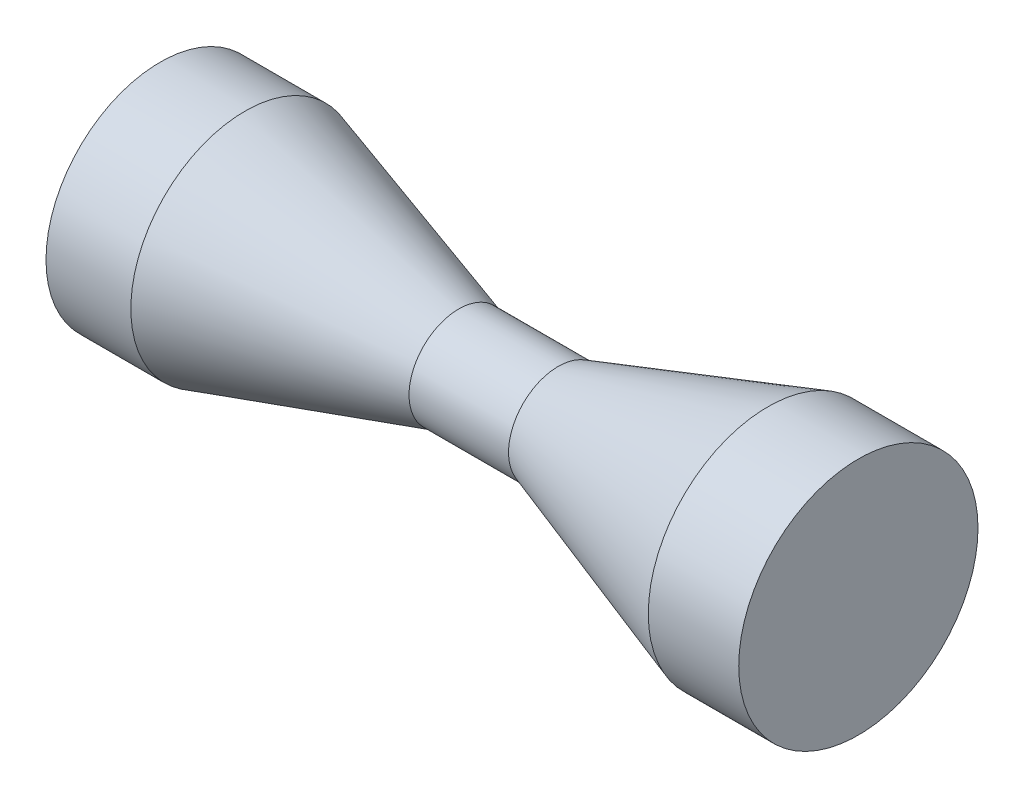
ISO-10303-21;
HEADER;
FILE_DESCRIPTION(('STEP AP214'),'2;1');
FILE_NAME('part.step','',(''),(''),'','','');
FILE_SCHEMA(('AUTOMOTIVE_DESIGN { 1 0 10303 214 1 1 1 1 }'));
ENDSEC;
DATA;
#1=APPLICATION_CONTEXT('core data for automotive mechanical design processes');
#2=APPLICATION_PROTOCOL_DEFINITION('international standard','automotive_design',2000,#1);
#3=PRODUCT_CONTEXT('',#1,'mechanical');
#4=PRODUCT('Part','Part','',(#3));
#5=PRODUCT_RELATED_PRODUCT_CATEGORY('part','',(#4));
#6=PRODUCT_DEFINITION_FORMATION('','',#4);
#7=PRODUCT_DEFINITION_CONTEXT('part definition',#1,'design');
#8=PRODUCT_DEFINITION('design','',#6,#7);
#9=PRODUCT_DEFINITION_SHAPE('','',#8);
#10=(LENGTH_UNIT() NAMED_UNIT(*) SI_UNIT(.MILLI.,.METRE.));
#11=(NAMED_UNIT(*) PLANE_ANGLE_UNIT() SI_UNIT($,.RADIAN.));
#12=(NAMED_UNIT(*) SI_UNIT($,.STERADIAN.) SOLID_ANGLE_UNIT());
#13=UNCERTAINTY_MEASURE_WITH_UNIT(LENGTH_MEASURE(1.E-05),#10,'distance_accuracy_value','');
#14=(GEOMETRIC_REPRESENTATION_CONTEXT(3) GLOBAL_UNCERTAINTY_ASSIGNED_CONTEXT((#13)) GLOBAL_UNIT_ASSIGNED_CONTEXT((#10,
#11,#12)) REPRESENTATION_CONTEXT('',''));
#15=CARTESIAN_POINT('',(0.,0.,0.));
#16=DIRECTION('',(0.,0.,1.));
#17=DIRECTION('',(1.,0.,0.));
#18=AXIS2_PLACEMENT_3D('',#15,#16,#17);
#19=CARTESIAN_POINT('',(0.,0.,0.));
#20=DIRECTION('',(1.,0.,0.));
#21=DIRECTION('',(0.,0.,-1.));
#22=AXIS2_PLACEMENT_3D('',#19,#20,#21);
#23=CYLINDRICAL_SURFACE('',#22,17.6042446248657);
#24=CARTESIAN_POINT('',(-38.6157624029311,0.,0.));
#25=DIRECTION('',(1.,0.,0.));
#26=DIRECTION('',(0.,0.,-1.));
#27=AXIS2_PLACEMENT_3D('',#24,#25,#26);
#28=CIRCLE('',#27,17.6042446248657);
#29=CARTESIAN_POINT('',(-38.6157624029311,0.,-17.6042446248657));
#30=VERTEX_POINT('',#29);
#31=EDGE_CURVE('E69',#30,#30,#28,.T.);
#32=ORIENTED_EDGE('',*,*,#31,.F.);
#33=EDGE_LOOP('',(#32));
#34=FACE_BOUND('',#33,.T.);
#35=CARTESIAN_POINT('',(-51.6894001508305,0.,0.));
#36=DIRECTION('',(-1.,0.,0.));
#37=DIRECTION('',(0.,0.,1.));
#38=AXIS2_PLACEMENT_3D('',#35,#36,#37);
#39=CIRCLE('',#38,17.6042446248657);
#40=CARTESIAN_POINT('',(-51.6894001508305,0.,17.6042446248657));
#41=VERTEX_POINT('',#40);
#42=EDGE_CURVE('E85',#41,#41,#39,.T.);
#43=ORIENTED_EDGE('',*,*,#42,.F.);
#44=EDGE_LOOP('',(#43));
#45=FACE_BOUND('',#44,.T.);
#46=ADVANCED_FACE('F40',(#34,#45),#23,.T.);
#47=CARTESIAN_POINT('',(-38.6157624029311,0.,0.));
#48=DIRECTION('',(-1.,0.,0.));
#49=DIRECTION('',(0.,0.,1.));
#50=AXIS2_PLACEMENT_3D('',#47,#48,#49);
#51=CONICAL_SURFACE('',#50,17.6042446248657,0.293037820828516);
#52=CARTESIAN_POINT('',(-5.67878858866636,0.,0.));
#53=DIRECTION('',(1.,0.,0.));
#54=DIRECTION('',(0.,0.,-1.));
#55=AXIS2_PLACEMENT_3D('',#52,#53,#54);
#56=CIRCLE('',#55,7.66636459469956);
#57=CARTESIAN_POINT('',(-5.67878858866636,0.,-7.66636459469956));
#58=VERTEX_POINT('',#57);
#59=EDGE_CURVE('E73',#58,#58,#56,.T.);
#60=ORIENTED_EDGE('',*,*,#59,.F.);
#61=EDGE_LOOP('',(#60));
#62=FACE_BOUND('',#61,.T.);
#63=ORIENTED_EDGE('',*,*,#31,.T.);
#64=EDGE_LOOP('',(#63));
#65=FACE_BOUND('',#64,.T.);
#66=ADVANCED_FACE('F117',(#62,#65),#51,.T.);
#67=CARTESIAN_POINT('',(0.,0.,0.));
#68=DIRECTION('',(1.,0.,0.));
#69=DIRECTION('',(0.,0.,-1.));
#70=AXIS2_PLACEMENT_3D('',#67,#68,#69);
#71=CYLINDRICAL_SURFACE('',#70,7.66636459469956);
#72=CARTESIAN_POINT('',(9.65394060073277,0.,0.));
#73=DIRECTION('',(1.,0.,0.));
#74=DIRECTION('',(0.,0.,-1.));
#75=AXIS2_PLACEMENT_3D('',#72,#73,#74);
#76=CIRCLE('',#75,7.66636459469956);
#77=CARTESIAN_POINT('',(9.65394060073277,0.,-7.66636459469956));
#78=VERTEX_POINT('',#77);
#79=EDGE_CURVE('E77',#78,#78,#76,.T.);
#80=ORIENTED_EDGE('',*,*,#79,.F.);
#81=EDGE_LOOP('',(#80));
#82=FACE_BOUND('',#81,.T.);
#83=ORIENTED_EDGE('',*,*,#59,.T.);
#84=EDGE_LOOP('',(#83));
#85=FACE_BOUND('',#84,.T.);
#86=ADVANCED_FACE('F112',(#82,#85),#71,.T.);
#87=CARTESIAN_POINT('',(9.65394060073277,0.,0.));
#88=DIRECTION('',(1.,0.,0.));
#89=DIRECTION('',(0.,0.,-1.));
#90=AXIS2_PLACEMENT_3D('',#87,#88,#89);
#91=CONICAL_SURFACE('',#90,7.66636459469956,0.321750554396642);
#92=CARTESIAN_POINT('',(41.9687141465649,0.,0.));
#93=DIRECTION('',(1.,0.,0.));
#94=DIRECTION('',(0.,0.,-1.));
#95=AXIS2_PLACEMENT_3D('',#92,#93,#94);
#96=CIRCLE('',#95,18.4379557766436);
#97=CARTESIAN_POINT('',(41.9687141465649,0.,-18.4379557766436));
#98=VERTEX_POINT('',#97);
#99=EDGE_CURVE('E81',#98,#98,#96,.T.);
#100=ORIENTED_EDGE('',*,*,#99,.F.);
#101=EDGE_LOOP('',(#100));
#102=FACE_BOUND('',#101,.T.);
#103=ORIENTED_EDGE('',*,*,#79,.T.);
#104=EDGE_LOOP('',(#103));
#105=FACE_BOUND('',#104,.T.);
#106=ADVANCED_FACE('F103',(#102,#105),#91,.T.);
#107=CARTESIAN_POINT('',(0.,0.,0.));
#108=DIRECTION('',(1.,0.,0.));
#109=DIRECTION('',(0.,0.,-1.));
#110=AXIS2_PLACEMENT_3D('',#107,#108,#109);
#111=CYLINDRICAL_SURFACE('',#110,18.4379557766436);
#112=ORIENTED_EDGE('',*,*,#99,.T.);
#113=EDGE_LOOP('',(#112));
#114=FACE_BOUND('',#113,.T.);
#115=CARTESIAN_POINT('',(55.9050132964019,0.,0.));
#116=DIRECTION('',(1.,0.,0.));
#117=DIRECTION('',(0.,0.,-1.));
#118=AXIS2_PLACEMENT_3D('',#115,#116,#117);
#119=CIRCLE('',#118,18.4379557766436);
#120=CARTESIAN_POINT('',(55.9050132964019,0.,-18.4379557766436));
#121=VERTEX_POINT('',#120);
#122=EDGE_CURVE('E90',#121,#121,#119,.T.);
#123=ORIENTED_EDGE('',*,*,#122,.F.);
#124=EDGE_LOOP('',(#123));
#125=FACE_BOUND('',#124,.T.);
#126=ADVANCED_FACE('F100',(#114,#125),#111,.T.);
#127=CARTESIAN_POINT('',(-51.6894001508305,0.,0.));
#128=DIRECTION('',(-1.,0.,0.));
#129=DIRECTION('',(0.,0.,1.));
#130=AXIS2_PLACEMENT_3D('',#127,#128,#129);
#131=PLANE('',#130);
#132=ORIENTED_EDGE('',*,*,#42,.T.);
#133=EDGE_LOOP('',(#132));
#134=FACE_BOUND('',#133,.T.);
#135=ADVANCED_FACE('F102',(#134),#131,.T.);
#136=CARTESIAN_POINT('',(55.9050132964019,0.,0.));
#137=DIRECTION('',(1.,0.,0.));
#138=DIRECTION('',(0.,0.,-1.));
#139=AXIS2_PLACEMENT_3D('',#136,#137,#138);
#140=PLANE('',#139);
#141=ORIENTED_EDGE('',*,*,#122,.T.);
#142=EDGE_LOOP('',(#141));
#143=FACE_BOUND('',#142,.T.);
#144=ADVANCED_FACE('F98',(#143),#140,.T.);
#145=CLOSED_SHELL('',(#46,#66,#86,#106,#126,#135,#144));
#146=CARTESIAN_POINT('',(-49.6894001508305,0.,0.));
#147=DIRECTION('',(-1.,0.,0.));
#148=DIRECTION('',(0.,0.,1.));
#149=AXIS2_PLACEMENT_3D('',#146,#147,#148);
#150=PLANE('',#149);
#151=CARTESIAN_POINT('',(-49.6894001508305,0.,0.));
#152=DIRECTION('',(1.,0.,0.));
#153=DIRECTION('',(0.,0.,-1.));
#154=AXIS2_PLACEMENT_3D('',#151,#152,#153);
#155=CIRCLE('',#154,15.6042446248657);
#156=CARTESIAN_POINT('',(-49.6894001508305,0.,-15.6042446248657));
#157=VERTEX_POINT('',#156);
#158=EDGE_CURVE('E65',#157,#157,#155,.T.);
#159=ORIENTED_EDGE('',*,*,#158,.T.);
#160=EDGE_LOOP('',(#159));
#161=FACE_BOUND('',#160,.T.);
#162=ADVANCED_FACE('F133',(#161),#150,.F.);
#163=CARTESIAN_POINT('',(0.,0.,0.));
#164=DIRECTION('',(1.,0.,0.));
#165=DIRECTION('',(0.,0.,-1.));
#166=AXIS2_PLACEMENT_3D('',#163,#164,#165);
#167=CYLINDRICAL_SURFACE('',#166,15.6042446248657);
#168=CARTESIAN_POINT('',(-38.9109153466664,0.,0.));
#169=DIRECTION('',(1.,0.,0.));
#170=DIRECTION('',(0.,0.,-1.));
#171=AXIS2_PLACEMENT_3D('',#168,#169,#170);
#172=CIRCLE('',#171,15.6042446248657);
#173=CARTESIAN_POINT('',(-38.9109153466664,0.,-15.6042446248657));
#174=VERTEX_POINT('',#173);
#175=EDGE_CURVE('E59',#174,#174,#172,.T.);
#176=ORIENTED_EDGE('',*,*,#175,.T.);
#177=EDGE_LOOP('',(#176));
#178=FACE_BOUND('',#177,.T.);
#179=ORIENTED_EDGE('',*,*,#158,.F.);
#180=EDGE_LOOP('',(#179));
#181=FACE_BOUND('',#180,.T.);
#182=ADVANCED_FACE('F129',(#178,#181),#167,.F.);
#183=CARTESIAN_POINT('',(-38.9109153466664,0.,0.));
#184=DIRECTION('',(-1.,0.,0.));
#185=DIRECTION('',(0.,0.,1.));
#186=AXIS2_PLACEMENT_3D('',#183,#184,#185);
#187=CONICAL_SURFACE('',#186,15.6042446248657,0.293037820828516);
#188=CARTESIAN_POINT('',(-5.97394153240159,0.,0.));
#189=DIRECTION('',(1.,0.,0.));
#190=DIRECTION('',(0.,0.,-1.));
#191=AXIS2_PLACEMENT_3D('',#188,#189,#190);
#192=CIRCLE('',#191,5.66636459469956);
#193=CARTESIAN_POINT('',(-5.97394153240159,0.,-5.66636459469956));
#194=VERTEX_POINT('',#193);
#195=EDGE_CURVE('E54',#194,#194,#192,.T.);
#196=ORIENTED_EDGE('',*,*,#195,.T.);
#197=EDGE_LOOP('',(#196));
#198=FACE_BOUND('',#197,.T.);
#199=ORIENTED_EDGE('',*,*,#175,.F.);
#200=EDGE_LOOP('',(#199));
#201=FACE_BOUND('',#200,.T.);
#202=ADVANCED_FACE('F132',(#198,#201),#187,.F.);
#203=CARTESIAN_POINT('',(0.,0.,0.));
#204=DIRECTION('',(1.,0.,0.));
#205=DIRECTION('',(0.,0.,-1.));
#206=AXIS2_PLACEMENT_3D('',#203,#204,#205);
#207=CYLINDRICAL_SURFACE('',#206,5.66636459469956);
#208=CARTESIAN_POINT('',(9.97849592106953,0.,0.));
#209=DIRECTION('',(1.,0.,0.));
#210=DIRECTION('',(0.,0.,-1.));
#211=AXIS2_PLACEMENT_3D('',#208,#209,#210);
#212=CIRCLE('',#211,5.66636459469956);
#213=CARTESIAN_POINT('',(9.97849592106953,0.,-5.66636459469956));
#214=VERTEX_POINT('',#213);
#215=EDGE_CURVE('E49',#214,#214,#212,.T.);
#216=ORIENTED_EDGE('',*,*,#215,.T.);
#217=EDGE_LOOP('',(#216));
#218=FACE_BOUND('',#217,.T.);
#219=ORIENTED_EDGE('',*,*,#195,.F.);
#220=EDGE_LOOP('',(#219));
#221=FACE_BOUND('',#220,.T.);
#222=ADVANCED_FACE('F138',(#218,#221),#207,.F.);
#223=CARTESIAN_POINT('',(9.97849592106953,0.,0.));
#224=DIRECTION('',(1.,0.,0.));
#225=DIRECTION('',(0.,0.,-1.));
#226=AXIS2_PLACEMENT_3D('',#223,#224,#225);
#227=CONICAL_SURFACE('',#226,5.66636459469956,0.321750554396642);
#228=CARTESIAN_POINT('',(42.2932694669017,0.,0.));
#229=DIRECTION('',(1.,0.,0.));
#230=DIRECTION('',(0.,0.,-1.));
#231=AXIS2_PLACEMENT_3D('',#228,#229,#230);
#232=CIRCLE('',#231,16.4379557766436);
#233=CARTESIAN_POINT('',(42.2932694669017,0.,-16.4379557766436));
#234=VERTEX_POINT('',#233);
#235=EDGE_CURVE('E10',#234,#234,#232,.T.);
#236=ORIENTED_EDGE('',*,*,#235,.T.);
#237=EDGE_LOOP('',(#236));
#238=FACE_BOUND('',#237,.T.);
#239=ORIENTED_EDGE('',*,*,#215,.F.);
#240=EDGE_LOOP('',(#239));
#241=FACE_BOUND('',#240,.T.);
#242=ADVANCED_FACE('F141',(#238,#241),#227,.F.);
#243=CARTESIAN_POINT('',(0.,0.,0.));
#244=DIRECTION('',(1.,0.,0.));
#245=DIRECTION('',(0.,0.,-1.));
#246=AXIS2_PLACEMENT_3D('',#243,#244,#245);
#247=CYLINDRICAL_SURFACE('',#246,16.4379557766436);
#248=CARTESIAN_POINT('',(53.9050132964019,0.,0.));
#249=DIRECTION('',(1.,0.,0.));
#250=DIRECTION('',(0.,0.,-1.));
#251=AXIS2_PLACEMENT_3D('',#248,#249,#250);
#252=CIRCLE('',#251,16.4379557766436);
#253=CARTESIAN_POINT('',(53.9050132964019,0.,-16.4379557766436));
#254=VERTEX_POINT('',#253);
#255=EDGE_CURVE('E86',#254,#254,#252,.T.);
#256=ORIENTED_EDGE('',*,*,#255,.T.);
#257=EDGE_LOOP('',(#256));
#258=FACE_BOUND('',#257,.T.);
#259=ORIENTED_EDGE('',*,*,#235,.F.);
#260=EDGE_LOOP('',(#259));
#261=FACE_BOUND('',#260,.T.);
#262=ADVANCED_FACE('F42',(#258,#261),#247,.F.);
#263=CARTESIAN_POINT('',(53.9050132964019,0.,0.));
#264=DIRECTION('',(1.,0.,0.));
#265=DIRECTION('',(0.,0.,-1.));
#266=AXIS2_PLACEMENT_3D('',#263,#264,#265);
#267=PLANE('',#266);
#268=ORIENTED_EDGE('',*,*,#255,.F.);
#269=EDGE_LOOP('',(#268));
#270=FACE_BOUND('',#269,.T.);
#271=ADVANCED_FACE('F146',(#270),#267,.F.);
#272=CLOSED_SHELL('',(#162,#182,#202,#222,#242,#262,#271));
#273=ORIENTED_CLOSED_SHELL('',*,#272,.T.);
#274=BREP_WITH_VOIDS('B2',#145,(#273));
#275=ADVANCED_BREP_SHAPE_REPRESENTATION('',(#18,#274),#14);
#276=SHAPE_DEFINITION_REPRESENTATION(#9,#275);
ENDSEC;
END-ISO-10303-21;
